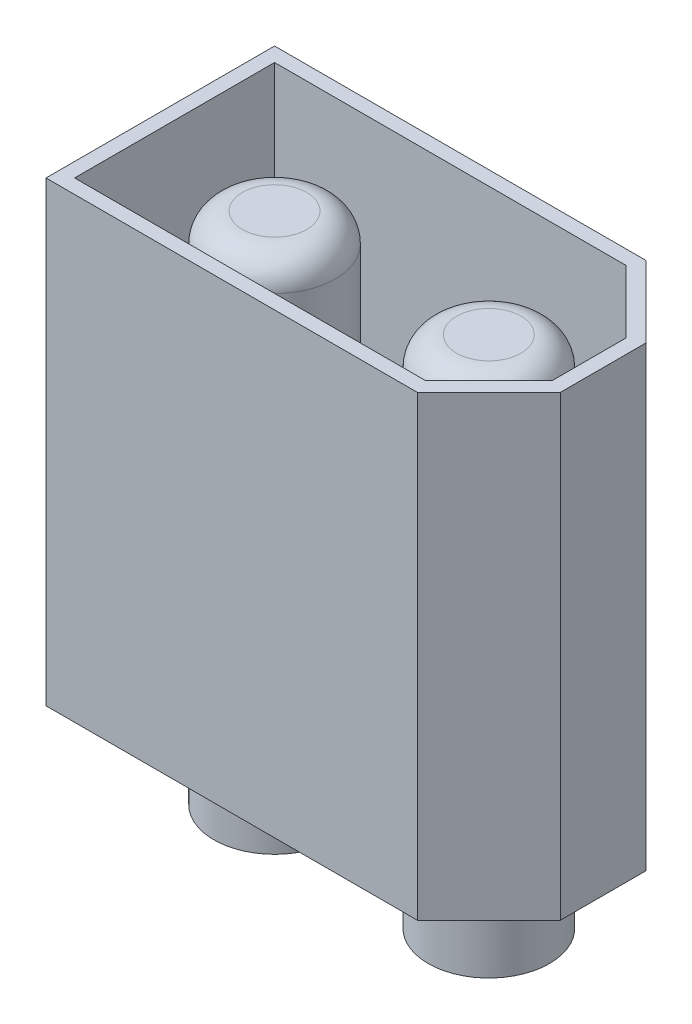
ISO-10303-21;
HEADER;
FILE_DESCRIPTION(('STEP AP214'),'2;1');
FILE_NAME('part.step','',(''),(''),'','','');
FILE_SCHEMA(('AUTOMOTIVE_DESIGN { 1 0 10303 214 1 1 1 1 }'));
ENDSEC;
DATA;
#1=APPLICATION_CONTEXT('core data for automotive mechanical design processes');
#2=APPLICATION_PROTOCOL_DEFINITION('international standard','automotive_design',2000,#1);
#3=PRODUCT_CONTEXT('',#1,'mechanical');
#4=PRODUCT('Part','Part','',(#3));
#5=PRODUCT_RELATED_PRODUCT_CATEGORY('part','',(#4));
#6=PRODUCT_DEFINITION_FORMATION('','',#4);
#7=PRODUCT_DEFINITION_CONTEXT('part definition',#1,'design');
#8=PRODUCT_DEFINITION('design','',#6,#7);
#9=PRODUCT_DEFINITION_SHAPE('','',#8);
#10=(LENGTH_UNIT() NAMED_UNIT(*) SI_UNIT(.MILLI.,.METRE.));
#11=(NAMED_UNIT(*) PLANE_ANGLE_UNIT() SI_UNIT($,.RADIAN.));
#12=(NAMED_UNIT(*) SI_UNIT($,.STERADIAN.) SOLID_ANGLE_UNIT());
#13=UNCERTAINTY_MEASURE_WITH_UNIT(LENGTH_MEASURE(1.E-05),#10,'distance_accuracy_value','');
#14=(GEOMETRIC_REPRESENTATION_CONTEXT(3) GLOBAL_UNCERTAINTY_ASSIGNED_CONTEXT((#13)) GLOBAL_UNIT_ASSIGNED_CONTEXT((#10,
#11,#12)) REPRESENTATION_CONTEXT('',''));
#15=CARTESIAN_POINT('',(0.,0.,0.));
#16=DIRECTION('',(0.,0.,1.));
#17=DIRECTION('',(1.,0.,0.));
#18=AXIS2_PLACEMENT_3D('',#15,#16,#17);
#19=CARTESIAN_POINT('',(0.,16.,4.));
#20=DIRECTION('',(0.,0.,-1.));
#21=DIRECTION('',(-1.,0.,0.));
#22=AXIS2_PLACEMENT_3D('',#19,#20,#21);
#23=PLANE('',#22);
#24=DIRECTION('',(1.,0.,0.));
#25=VECTOR('',#24,1.);
#26=CARTESIAN_POINT('',(0.,0.,4.));
#27=LINE('',#26,#25);
#28=CARTESIAN_POINT('',(-7.75,0.,4.));
#29=VERTEX_POINT('',#28);
#30=CARTESIAN_POINT('',(5.25,0.,4.));
#31=VERTEX_POINT('',#30);
#32=EDGE_CURVE('E154',#29,#31,#27,.T.);
#33=ORIENTED_EDGE('',*,*,#32,.T.);
#34=DIRECTION('',(0.,-1.,0.));
#35=VECTOR('',#34,1.);
#36=CARTESIAN_POINT('',(5.25,16.,4.));
#37=LINE('',#36,#35);
#38=CARTESIAN_POINT('',(5.25,16.,4.));
#39=VERTEX_POINT('',#38);
#40=EDGE_CURVE('E184',#39,#31,#37,.T.);
#41=ORIENTED_EDGE('',*,*,#40,.F.);
#42=DIRECTION('',(1.,0.,0.));
#43=VECTOR('',#42,1.);
#44=CARTESIAN_POINT('',(0.,16.,4.));
#45=LINE('',#44,#43);
#46=CARTESIAN_POINT('',(-7.75,16.,4.));
#47=VERTEX_POINT('',#46);
#48=EDGE_CURVE('E174',#47,#39,#45,.T.);
#49=ORIENTED_EDGE('',*,*,#48,.F.);
#50=DIRECTION('',(0.,-1.,0.));
#51=VECTOR('',#50,1.);
#52=CARTESIAN_POINT('',(-7.75,16.,4.));
#53=LINE('',#52,#51);
#54=EDGE_CURVE('E150',#47,#29,#53,.T.);
#55=ORIENTED_EDGE('',*,*,#54,.T.);
#56=EDGE_LOOP('',(#33,#41,#49,#55));
#57=FACE_BOUND('',#56,.T.);
#58=ADVANCED_FACE('F53',(#57),#23,.F.);
#59=CARTESIAN_POINT('',(4.625,16.,4.625));
#60=DIRECTION('',(-0.707106781186547,0.,-0.707106781186547));
#61=DIRECTION('',(-0.707106781186548,0.,0.707106781186548));
#62=AXIS2_PLACEMENT_3D('',#59,#60,#61);
#63=PLANE('',#62);
#64=DIRECTION('',(0.707106781186548,0.,-0.707106781186548));
#65=VECTOR('',#64,1.);
#66=CARTESIAN_POINT('',(4.625,0.,4.625));
#67=LINE('',#66,#65);
#68=CARTESIAN_POINT('',(7.75,0.,1.5));
#69=VERTEX_POINT('',#68);
#70=EDGE_CURVE('E158',#31,#69,#67,.T.);
#71=ORIENTED_EDGE('',*,*,#70,.T.);
#72=DIRECTION('',(0.,-1.,0.));
#73=VECTOR('',#72,1.);
#74=CARTESIAN_POINT('',(7.75,16.,1.5));
#75=LINE('',#74,#73);
#76=CARTESIAN_POINT('',(7.75,16.,1.5));
#77=VERTEX_POINT('',#76);
#78=EDGE_CURVE('E181',#77,#69,#75,.T.);
#79=ORIENTED_EDGE('',*,*,#78,.F.);
#80=DIRECTION('',(0.707106781186548,0.,-0.707106781186548));
#81=VECTOR('',#80,1.);
#82=CARTESIAN_POINT('',(4.625,16.,4.625));
#83=LINE('',#82,#81);
#84=EDGE_CURVE('E114',#39,#77,#83,.T.);
#85=ORIENTED_EDGE('',*,*,#84,.F.);
#86=ORIENTED_EDGE('',*,*,#40,.T.);
#87=EDGE_LOOP('',(#71,#79,#85,#86));
#88=FACE_BOUND('',#87,.T.);
#89=ADVANCED_FACE('F214',(#88),#63,.F.);
#90=CARTESIAN_POINT('',(7.75,16.,0.));
#91=DIRECTION('',(1.,0.,0.));
#92=DIRECTION('',(0.,0.,-1.));
#93=AXIS2_PLACEMENT_3D('',#90,#91,#92);
#94=PLANE('',#93);
#95=DIRECTION('',(0.,0.,1.));
#96=VECTOR('',#95,1.);
#97=CARTESIAN_POINT('',(7.75,0.,0.));
#98=LINE('',#97,#96);
#99=CARTESIAN_POINT('',(7.75,0.,-1.5));
#100=VERTEX_POINT('',#99);
#101=EDGE_CURVE('E163',#100,#69,#98,.T.);
#102=ORIENTED_EDGE('',*,*,#101,.F.);
#103=DIRECTION('',(0.,-1.,0.));
#104=VECTOR('',#103,1.);
#105=CARTESIAN_POINT('',(7.75,16.,-1.5));
#106=LINE('',#105,#104);
#107=CARTESIAN_POINT('',(7.75,16.,-1.5));
#108=VERTEX_POINT('',#107);
#109=EDGE_CURVE('E136',#108,#100,#106,.T.);
#110=ORIENTED_EDGE('',*,*,#109,.F.);
#111=DIRECTION('',(0.,0.,1.));
#112=VECTOR('',#111,1.);
#113=CARTESIAN_POINT('',(7.75,16.,0.));
#114=LINE('',#113,#112);
#115=EDGE_CURVE('E143',#108,#77,#114,.T.);
#116=ORIENTED_EDGE('',*,*,#115,.T.);
#117=ORIENTED_EDGE('',*,*,#78,.T.);
#118=EDGE_LOOP('',(#102,#110,#116,#117));
#119=FACE_BOUND('',#118,.T.);
#120=ADVANCED_FACE('F220',(#119),#94,.T.);
#121=CARTESIAN_POINT('',(4.625,16.,-4.625));
#122=DIRECTION('',(0.707106781186547,0.,-0.707106781186548));
#123=DIRECTION('',(-0.707106781186548,0.,-0.707106781186547));
#124=AXIS2_PLACEMENT_3D('',#121,#122,#123);
#125=PLANE('',#124);
#126=DIRECTION('',(0.707106781186548,0.,0.707106781186547));
#127=VECTOR('',#126,1.);
#128=CARTESIAN_POINT('',(4.625,0.,-4.625));
#129=LINE('',#128,#127);
#130=CARTESIAN_POINT('',(5.25,0.,-4.));
#131=VERTEX_POINT('',#130);
#132=EDGE_CURVE('E130',#131,#100,#129,.T.);
#133=ORIENTED_EDGE('',*,*,#132,.F.);
#134=DIRECTION('',(0.,-1.,0.));
#135=VECTOR('',#134,1.);
#136=CARTESIAN_POINT('',(5.25,16.,-4.));
#137=LINE('',#136,#135);
#138=CARTESIAN_POINT('',(5.25,16.,-4.));
#139=VERTEX_POINT('',#138);
#140=EDGE_CURVE('E125',#139,#131,#137,.T.);
#141=ORIENTED_EDGE('',*,*,#140,.F.);
#142=DIRECTION('',(0.707106781186548,0.,0.707106781186547));
#143=VECTOR('',#142,1.);
#144=CARTESIAN_POINT('',(4.625,16.,-4.625));
#145=LINE('',#144,#143);
#146=EDGE_CURVE('E128',#139,#108,#145,.T.);
#147=ORIENTED_EDGE('',*,*,#146,.T.);
#148=ORIENTED_EDGE('',*,*,#109,.T.);
#149=EDGE_LOOP('',(#133,#141,#147,#148));
#150=FACE_BOUND('',#149,.T.);
#151=ADVANCED_FACE('F127',(#150),#125,.T.);
#152=CARTESIAN_POINT('',(0.,16.,-4.));
#153=DIRECTION('',(0.,0.,-1.));
#154=DIRECTION('',(-1.,0.,0.));
#155=AXIS2_PLACEMENT_3D('',#152,#153,#154);
#156=PLANE('',#155);
#157=DIRECTION('',(1.,0.,0.));
#158=VECTOR('',#157,1.);
#159=CARTESIAN_POINT('',(0.,0.,-4.));
#160=LINE('',#159,#158);
#161=CARTESIAN_POINT('',(-7.75,0.,-4.));
#162=VERTEX_POINT('',#161);
#163=EDGE_CURVE('E169',#162,#131,#160,.T.);
#164=ORIENTED_EDGE('',*,*,#163,.F.);
#165=DIRECTION('',(0.,-1.,0.));
#166=VECTOR('',#165,1.);
#167=CARTESIAN_POINT('',(-7.75,16.,-4.));
#168=LINE('',#167,#166);
#169=CARTESIAN_POINT('',(-7.75,16.,-4.));
#170=VERTEX_POINT('',#169);
#171=EDGE_CURVE('E137',#170,#162,#168,.T.);
#172=ORIENTED_EDGE('',*,*,#171,.F.);
#173=DIRECTION('',(1.,0.,0.));
#174=VECTOR('',#173,1.);
#175=CARTESIAN_POINT('',(0.,16.,-4.));
#176=LINE('',#175,#174);
#177=EDGE_CURVE('E141',#170,#139,#176,.T.);
#178=ORIENTED_EDGE('',*,*,#177,.T.);
#179=ORIENTED_EDGE('',*,*,#140,.T.);
#180=EDGE_LOOP('',(#164,#172,#178,#179));
#181=FACE_BOUND('',#180,.T.);
#182=ADVANCED_FACE('F146',(#181),#156,.T.);
#183=CARTESIAN_POINT('',(-7.75,16.,0.));
#184=DIRECTION('',(1.,0.,0.));
#185=DIRECTION('',(0.,0.,-1.));
#186=AXIS2_PLACEMENT_3D('',#183,#184,#185);
#187=PLANE('',#186);
#188=DIRECTION('',(0.,0.,1.));
#189=VECTOR('',#188,1.);
#190=CARTESIAN_POINT('',(-7.75,0.,0.));
#191=LINE('',#190,#189);
#192=EDGE_CURVE('E105',#162,#29,#191,.T.);
#193=ORIENTED_EDGE('',*,*,#192,.T.);
#194=ORIENTED_EDGE('',*,*,#54,.F.);
#195=DIRECTION('',(0.,0.,1.));
#196=VECTOR('',#195,1.);
#197=CARTESIAN_POINT('',(-7.75,16.,0.));
#198=LINE('',#197,#196);
#199=EDGE_CURVE('E78',#170,#47,#198,.T.);
#200=ORIENTED_EDGE('',*,*,#199,.F.);
#201=ORIENTED_EDGE('',*,*,#171,.T.);
#202=EDGE_LOOP('',(#193,#194,#200,#201));
#203=FACE_BOUND('',#202,.T.);
#204=ADVANCED_FACE('F230',(#203),#187,.F.);
#205=CARTESIAN_POINT('',(0.,16.,0.));
#206=DIRECTION('',(0.,1.,0.));
#207=DIRECTION('',(0.,0.,1.));
#208=AXIS2_PLACEMENT_3D('',#205,#206,#207);
#209=PLANE('',#208);
#210=DIRECTION('',(1.,0.,0.));
#211=VECTOR('',#210,1.);
#212=CARTESIAN_POINT('',(0.,16.,3.5));
#213=LINE('',#212,#211);
#214=CARTESIAN_POINT('',(-7.25,16.,3.5));
#215=VERTEX_POINT('',#214);
#216=CARTESIAN_POINT('',(5.04289321881345,16.,3.5));
#217=VERTEX_POINT('',#216);
#218=EDGE_CURVE('E686',#215,#217,#213,.T.);
#219=ORIENTED_EDGE('',*,*,#218,.F.);
#220=DIRECTION('',(0.,0.,1.));
#221=VECTOR('',#220,1.);
#222=CARTESIAN_POINT('',(-7.25,16.,0.));
#223=LINE('',#222,#221);
#224=CARTESIAN_POINT('',(-7.25,16.,-3.5));
#225=VERTEX_POINT('',#224);
#226=EDGE_CURVE('E653',#225,#215,#223,.T.);
#227=ORIENTED_EDGE('',*,*,#226,.F.);
#228=DIRECTION('',(1.,0.,0.));
#229=VECTOR('',#228,1.);
#230=CARTESIAN_POINT('',(0.,16.,-3.5));
#231=LINE('',#230,#229);
#232=CARTESIAN_POINT('',(5.04289321881345,16.,-3.5));
#233=VERTEX_POINT('',#232);
#234=EDGE_CURVE('E69',#225,#233,#231,.T.);
#235=ORIENTED_EDGE('',*,*,#234,.T.);
#236=DIRECTION('',(0.707106781186548,0.,0.707106781186547));
#237=VECTOR('',#236,1.);
#238=CARTESIAN_POINT('',(4.27144660940673,16.,-4.27144660940673));
#239=LINE('',#238,#237);
#240=CARTESIAN_POINT('',(7.25,16.,-1.29289321881345));
#241=VERTEX_POINT('',#240);
#242=EDGE_CURVE('E698',#233,#241,#239,.T.);
#243=ORIENTED_EDGE('',*,*,#242,.T.);
#244=DIRECTION('',(0.,0.,1.));
#245=VECTOR('',#244,1.);
#246=CARTESIAN_POINT('',(7.25,16.,0.));
#247=LINE('',#246,#245);
#248=CARTESIAN_POINT('',(7.25,16.,1.29289321881345));
#249=VERTEX_POINT('',#248);
#250=EDGE_CURVE('E694',#241,#249,#247,.T.);
#251=ORIENTED_EDGE('',*,*,#250,.T.);
#252=DIRECTION('',(0.707106781186548,0.,-0.707106781186548));
#253=VECTOR('',#252,1.);
#254=CARTESIAN_POINT('',(4.27144660940673,16.,4.27144660940673));
#255=LINE('',#254,#253);
#256=EDGE_CURVE('E690',#217,#249,#255,.T.);
#257=ORIENTED_EDGE('',*,*,#256,.F.);
#258=EDGE_LOOP('',(#219,#227,#235,#243,#251,#257));
#259=FACE_BOUND('',#258,.T.);
#260=ORIENTED_EDGE('',*,*,#48,.T.);
#261=ORIENTED_EDGE('',*,*,#84,.T.);
#262=ORIENTED_EDGE('',*,*,#115,.F.);
#263=ORIENTED_EDGE('',*,*,#146,.F.);
#264=ORIENTED_EDGE('',*,*,#177,.F.);
#265=ORIENTED_EDGE('',*,*,#199,.T.);
#266=EDGE_LOOP('',(#260,#261,#262,#263,#264,#265));
#267=FACE_BOUND('',#266,.T.);
#268=ADVANCED_FACE('F140',(#259,#267),#209,.T.);
#269=CARTESIAN_POINT('',(0.,0.,0.));
#270=DIRECTION('',(0.,1.,0.));
#271=DIRECTION('',(0.,0.,1.));
#272=AXIS2_PLACEMENT_3D('',#269,#270,#271);
#273=PLANE('',#272);
#274=CARTESIAN_POINT('',(-3.75,0.,0.));
#275=DIRECTION('',(0.,-1.,0.));
#276=DIRECTION('',(0.,0.,-1.));
#277=AXIS2_PLACEMENT_3D('',#274,#275,#276);
#278=CIRCLE('',#277,3.);
#279=CARTESIAN_POINT('',(-3.75,0.,-3.));
#280=VERTEX_POINT('',#279);
#281=EDGE_CURVE('E629',#280,#280,#278,.T.);
#282=ORIENTED_EDGE('',*,*,#281,.F.);
#283=EDGE_LOOP('',(#282));
#284=FACE_BOUND('',#283,.T.);
#285=CARTESIAN_POINT('',(3.75,0.,0.));
#286=DIRECTION('',(0.,-1.,0.));
#287=DIRECTION('',(0.,0.,1.));
#288=AXIS2_PLACEMENT_3D('',#285,#286,#287);
#289=CIRCLE('',#288,3.);
#290=CARTESIAN_POINT('',(3.75,0.,3.));
#291=VERTEX_POINT('',#290);
#292=EDGE_CURVE('E633',#291,#291,#289,.T.);
#293=ORIENTED_EDGE('',*,*,#292,.F.);
#294=EDGE_LOOP('',(#293));
#295=FACE_BOUND('',#294,.T.);
#296=ORIENTED_EDGE('',*,*,#32,.F.);
#297=ORIENTED_EDGE('',*,*,#192,.F.);
#298=ORIENTED_EDGE('',*,*,#163,.T.);
#299=ORIENTED_EDGE('',*,*,#132,.T.);
#300=ORIENTED_EDGE('',*,*,#101,.T.);
#301=ORIENTED_EDGE('',*,*,#70,.F.);
#302=EDGE_LOOP('',(#296,#297,#298,#299,#300,#301));
#303=FACE_BOUND('',#302,.T.);
#304=ADVANCED_FACE('F233',(#284,#295,#303),#273,.F.);
#305=CARTESIAN_POINT('',(0.,16.,3.5));
#306=DIRECTION('',(0.,0.,-1.));
#307=DIRECTION('',(-1.,0.,0.));
#308=AXIS2_PLACEMENT_3D('',#305,#306,#307);
#309=PLANE('',#308);
#310=DIRECTION('',(1.,0.,0.));
#311=VECTOR('',#310,1.);
#312=CARTESIAN_POINT('',(0.,7.,3.5));
#313=LINE('',#312,#311);
#314=CARTESIAN_POINT('',(-7.25,7.,3.5));
#315=VERTEX_POINT('',#314);
#316=CARTESIAN_POINT('',(5.04289321881345,7.,3.5));
#317=VERTEX_POINT('',#316);
#318=EDGE_CURVE('E628',#315,#317,#313,.T.);
#319=ORIENTED_EDGE('',*,*,#318,.F.);
#320=DIRECTION('',(0.,-1.,0.));
#321=VECTOR('',#320,1.);
#322=CARTESIAN_POINT('',(-7.25,16.,3.5));
#323=LINE('',#322,#321);
#324=EDGE_CURVE('E648',#215,#315,#323,.T.);
#325=ORIENTED_EDGE('',*,*,#324,.F.);
#326=ORIENTED_EDGE('',*,*,#218,.T.);
#327=DIRECTION('',(0.,-1.,0.));
#328=VECTOR('',#327,1.);
#329=CARTESIAN_POINT('',(5.04289321881345,16.,3.5));
#330=LINE('',#329,#328);
#331=EDGE_CURVE('E159',#217,#317,#330,.T.);
#332=ORIENTED_EDGE('',*,*,#331,.T.);
#333=EDGE_LOOP('',(#319,#325,#326,#332));
#334=FACE_BOUND('',#333,.T.);
#335=ADVANCED_FACE('F236',(#334),#309,.T.);
#336=CARTESIAN_POINT('',(4.27144660940673,16.,4.27144660940673));
#337=DIRECTION('',(-0.707106781186547,0.,-0.707106781186547));
#338=DIRECTION('',(-0.707106781186548,0.,0.707106781186548));
#339=AXIS2_PLACEMENT_3D('',#336,#337,#338);
#340=PLANE('',#339);
#341=DIRECTION('',(0.707106781186548,0.,-0.707106781186548));
#342=VECTOR('',#341,1.);
#343=CARTESIAN_POINT('',(4.27144660940673,7.,4.27144660940673));
#344=LINE('',#343,#342);
#345=CARTESIAN_POINT('',(7.25,7.,1.29289321881345));
#346=VERTEX_POINT('',#345);
#347=EDGE_CURVE('E643',#317,#346,#344,.T.);
#348=ORIENTED_EDGE('',*,*,#347,.F.);
#349=ORIENTED_EDGE('',*,*,#331,.F.);
#350=ORIENTED_EDGE('',*,*,#256,.T.);
#351=DIRECTION('',(0.,-1.,0.));
#352=VECTOR('',#351,1.);
#353=CARTESIAN_POINT('',(7.25,16.,1.29289321881345));
#354=LINE('',#353,#352);
#355=EDGE_CURVE('E647',#249,#346,#354,.T.);
#356=ORIENTED_EDGE('',*,*,#355,.T.);
#357=EDGE_LOOP('',(#348,#349,#350,#356));
#358=FACE_BOUND('',#357,.T.);
#359=ADVANCED_FACE('F260',(#358),#340,.T.);
#360=CARTESIAN_POINT('',(7.25,16.,0.));
#361=DIRECTION('',(1.,0.,0.));
#362=DIRECTION('',(0.,0.,-1.));
#363=AXIS2_PLACEMENT_3D('',#360,#361,#362);
#364=PLANE('',#363);
#365=DIRECTION('',(0.,0.,1.));
#366=VECTOR('',#365,1.);
#367=CARTESIAN_POINT('',(7.25,7.,0.));
#368=LINE('',#367,#366);
#369=CARTESIAN_POINT('',(7.25,7.,-1.29289321881345));
#370=VERTEX_POINT('',#369);
#371=EDGE_CURVE('E657',#370,#346,#368,.T.);
#372=ORIENTED_EDGE('',*,*,#371,.T.);
#373=ORIENTED_EDGE('',*,*,#355,.F.);
#374=ORIENTED_EDGE('',*,*,#250,.F.);
#375=DIRECTION('',(0.,-1.,0.));
#376=VECTOR('',#375,1.);
#377=CARTESIAN_POINT('',(7.25,16.,-1.29289321881345));
#378=LINE('',#377,#376);
#379=EDGE_CURVE('E661',#241,#370,#378,.T.);
#380=ORIENTED_EDGE('',*,*,#379,.T.);
#381=EDGE_LOOP('',(#372,#373,#374,#380));
#382=FACE_BOUND('',#381,.T.);
#383=ADVANCED_FACE('F256',(#382),#364,.F.);
#384=CARTESIAN_POINT('',(4.27144660940673,16.,-4.27144660940673));
#385=DIRECTION('',(0.707106781186547,0.,-0.707106781186548));
#386=DIRECTION('',(-0.707106781186548,0.,-0.707106781186547));
#387=AXIS2_PLACEMENT_3D('',#384,#385,#386);
#388=PLANE('',#387);
#389=DIRECTION('',(0.707106781186548,0.,0.707106781186547));
#390=VECTOR('',#389,1.);
#391=CARTESIAN_POINT('',(4.27144660940673,7.,-4.27144660940673));
#392=LINE('',#391,#390);
#393=CARTESIAN_POINT('',(5.04289321881345,7.,-3.5));
#394=VERTEX_POINT('',#393);
#395=EDGE_CURVE('E665',#394,#370,#392,.T.);
#396=ORIENTED_EDGE('',*,*,#395,.T.);
#397=ORIENTED_EDGE('',*,*,#379,.F.);
#398=ORIENTED_EDGE('',*,*,#242,.F.);
#399=DIRECTION('',(0.,-1.,0.));
#400=VECTOR('',#399,1.);
#401=CARTESIAN_POINT('',(5.04289321881345,16.,-3.5));
#402=LINE('',#401,#400);
#403=EDGE_CURVE('E669',#233,#394,#402,.T.);
#404=ORIENTED_EDGE('',*,*,#403,.T.);
#405=EDGE_LOOP('',(#396,#397,#398,#404));
#406=FACE_BOUND('',#405,.T.);
#407=ADVANCED_FACE('F253',(#406),#388,.F.);
#408=CARTESIAN_POINT('',(0.,16.,-3.5));
#409=DIRECTION('',(0.,0.,-1.));
#410=DIRECTION('',(-1.,0.,0.));
#411=AXIS2_PLACEMENT_3D('',#408,#409,#410);
#412=PLANE('',#411);
#413=DIRECTION('',(1.,0.,0.));
#414=VECTOR('',#413,1.);
#415=CARTESIAN_POINT('',(0.,7.,-3.5));
#416=LINE('',#415,#414);
#417=CARTESIAN_POINT('',(-7.25,7.,-3.5));
#418=VERTEX_POINT('',#417);
#419=EDGE_CURVE('E673',#418,#394,#416,.T.);
#420=ORIENTED_EDGE('',*,*,#419,.T.);
#421=ORIENTED_EDGE('',*,*,#403,.F.);
#422=ORIENTED_EDGE('',*,*,#234,.F.);
#423=DIRECTION('',(0.,-1.,0.));
#424=VECTOR('',#423,1.);
#425=CARTESIAN_POINT('',(-7.25,16.,-3.5));
#426=LINE('',#425,#424);
#427=EDGE_CURVE('E652',#225,#418,#426,.T.);
#428=ORIENTED_EDGE('',*,*,#427,.T.);
#429=EDGE_LOOP('',(#420,#421,#422,#428));
#430=FACE_BOUND('',#429,.T.);
#431=ADVANCED_FACE('F249',(#430),#412,.F.);
#432=CARTESIAN_POINT('',(-7.25,16.,0.));
#433=DIRECTION('',(1.,0.,0.));
#434=DIRECTION('',(0.,0.,-1.));
#435=AXIS2_PLACEMENT_3D('',#432,#433,#434);
#436=PLANE('',#435);
#437=DIRECTION('',(0.,0.,1.));
#438=VECTOR('',#437,1.);
#439=CARTESIAN_POINT('',(-7.25,7.,0.));
#440=LINE('',#439,#438);
#441=EDGE_CURVE('E680',#418,#315,#440,.T.);
#442=ORIENTED_EDGE('',*,*,#441,.F.);
#443=ORIENTED_EDGE('',*,*,#427,.F.);
#444=ORIENTED_EDGE('',*,*,#226,.T.);
#445=ORIENTED_EDGE('',*,*,#324,.T.);
#446=EDGE_LOOP('',(#442,#443,#444,#445));
#447=FACE_BOUND('',#446,.T.);
#448=ADVANCED_FACE('F245',(#447),#436,.T.);
#449=CARTESIAN_POINT('',(0.,7.,0.));
#450=DIRECTION('',(0.,1.,0.));
#451=DIRECTION('',(0.,0.,1.));
#452=AXIS2_PLACEMENT_3D('',#449,#450,#451);
#453=PLANE('',#452);
#454=CARTESIAN_POINT('',(3.75,7.,0.));
#455=DIRECTION('',(0.,1.,0.));
#456=DIRECTION('',(0.,0.,1.));
#457=AXIS2_PLACEMENT_3D('',#454,#455,#456);
#458=CIRCLE('',#457,2.125);
#459=CARTESIAN_POINT('',(3.75,7.,2.125));
#460=VERTEX_POINT('',#459);
#461=EDGE_CURVE('E603',#460,#460,#458,.T.);
#462=ORIENTED_EDGE('',*,*,#461,.F.);
#463=EDGE_LOOP('',(#462));
#464=FACE_BOUND('',#463,.T.);
#465=CARTESIAN_POINT('',(-3.75,7.,0.));
#466=DIRECTION('',(0.,1.,0.));
#467=DIRECTION('',(0.,0.,1.));
#468=AXIS2_PLACEMENT_3D('',#465,#466,#467);
#469=CIRCLE('',#468,2.125);
#470=CARTESIAN_POINT('',(-3.75,7.,2.125));
#471=VERTEX_POINT('',#470);
#472=EDGE_CURVE('E605',#471,#471,#469,.T.);
#473=ORIENTED_EDGE('',*,*,#472,.F.);
#474=EDGE_LOOP('',(#473));
#475=FACE_BOUND('',#474,.T.);
#476=ORIENTED_EDGE('',*,*,#318,.T.);
#477=ORIENTED_EDGE('',*,*,#347,.T.);
#478=ORIENTED_EDGE('',*,*,#371,.F.);
#479=ORIENTED_EDGE('',*,*,#395,.F.);
#480=ORIENTED_EDGE('',*,*,#419,.F.);
#481=ORIENTED_EDGE('',*,*,#441,.T.);
#482=EDGE_LOOP('',(#476,#477,#478,#479,#480,#481));
#483=FACE_BOUND('',#482,.T.);
#484=ADVANCED_FACE('F241',(#464,#475,#483),#453,.T.);
#485=CARTESIAN_POINT('',(3.75,1.5,0.));
#486=DIRECTION('',(0.,-1.,0.));
#487=DIRECTION('',(0.,0.,-1.));
#488=AXIS2_PLACEMENT_3D('',#485,#486,#487);
#489=CYLINDRICAL_SURFACE('',#488,3.);
#490=CARTESIAN_POINT('',(3.75,1.5,0.));
#491=DIRECTION('',(0.,-1.,0.));
#492=DIRECTION('',(0.,0.,1.));
#493=AXIS2_PLACEMENT_3D('',#490,#491,#492);
#494=CIRCLE('',#493,3.);
#495=CARTESIAN_POINT('',(3.75,1.5,3.));
#496=VERTEX_POINT('',#495);
#497=EDGE_CURVE('E620',#496,#496,#494,.T.);
#498=ORIENTED_EDGE('',*,*,#497,.F.);
#499=EDGE_LOOP('',(#498));
#500=FACE_BOUND('',#499,.T.);
#501=ORIENTED_EDGE('',*,*,#292,.T.);
#502=EDGE_LOOP('',(#501));
#503=FACE_BOUND('',#502,.T.);
#504=ADVANCED_FACE('F244',(#500,#503),#489,.F.);
#505=CARTESIAN_POINT('',(3.75,1.5,0.));
#506=DIRECTION('',(0.,1.,0.));
#507=DIRECTION('',(0.,0.,1.));
#508=AXIS2_PLACEMENT_3D('',#505,#506,#507);
#509=PLANE('',#508);
#510=CARTESIAN_POINT('',(3.75,1.5,0.));
#511=DIRECTION('',(0.,1.,0.));
#512=DIRECTION('',(0.,0.,1.));
#513=AXIS2_PLACEMENT_3D('',#510,#511,#512);
#514=CIRCLE('',#513,2.125);
#515=CARTESIAN_POINT('',(3.75,1.5,2.125));
#516=VERTEX_POINT('',#515);
#517=EDGE_CURVE('E187',#516,#516,#514,.F.);
#518=ORIENTED_EDGE('',*,*,#517,.F.);
#519=EDGE_LOOP('',(#518));
#520=FACE_BOUND('',#519,.T.);
#521=ORIENTED_EDGE('',*,*,#497,.T.);
#522=EDGE_LOOP('',(#521));
#523=FACE_BOUND('',#522,.T.);
#524=ADVANCED_FACE('F268',(#520,#523),#509,.F.);
#525=CARTESIAN_POINT('',(-3.75,1.5,0.));
#526=DIRECTION('',(0.,-1.,0.));
#527=DIRECTION('',(0.,0.,-1.));
#528=AXIS2_PLACEMENT_3D('',#525,#526,#527);
#529=CYLINDRICAL_SURFACE('',#528,3.);
#530=CARTESIAN_POINT('',(-3.75,1.5,0.));
#531=DIRECTION('',(0.,-1.,0.));
#532=DIRECTION('',(0.,0.,-1.));
#533=AXIS2_PLACEMENT_3D('',#530,#531,#532);
#534=CIRCLE('',#533,3.);
#535=CARTESIAN_POINT('',(-3.75,1.5,-3.));
#536=VERTEX_POINT('',#535);
#537=EDGE_CURVE('E624',#536,#536,#534,.T.);
#538=ORIENTED_EDGE('',*,*,#537,.F.);
#539=EDGE_LOOP('',(#538));
#540=FACE_BOUND('',#539,.T.);
#541=ORIENTED_EDGE('',*,*,#281,.T.);
#542=EDGE_LOOP('',(#541));
#543=FACE_BOUND('',#542,.T.);
#544=ADVANCED_FACE('F271',(#540,#543),#529,.F.);
#545=CARTESIAN_POINT('',(-3.75,1.5,0.));
#546=DIRECTION('',(0.,-1.,0.));
#547=DIRECTION('',(0.,0.,-1.));
#548=AXIS2_PLACEMENT_3D('',#545,#546,#547);
#549=PLANE('',#548);
#550=CARTESIAN_POINT('',(-3.75,1.5,0.));
#551=DIRECTION('',(0.,-1.,0.));
#552=DIRECTION('',(0.,0.,-1.));
#553=AXIS2_PLACEMENT_3D('',#550,#551,#552);
#554=CIRCLE('',#553,2.125);
#555=CARTESIAN_POINT('',(-3.75,1.5,-2.125));
#556=VERTEX_POINT('',#555);
#557=EDGE_CURVE('E615',#556,#556,#554,.T.);
#558=ORIENTED_EDGE('',*,*,#557,.F.);
#559=EDGE_LOOP('',(#558));
#560=FACE_BOUND('',#559,.T.);
#561=ORIENTED_EDGE('',*,*,#537,.T.);
#562=EDGE_LOOP('',(#561));
#563=FACE_BOUND('',#562,.T.);
#564=ADVANCED_FACE('F278',(#560,#563),#549,.T.);
#565=CARTESIAN_POINT('',(-3.75,-3.,0.));
#566=DIRECTION('',(0.,1.,0.));
#567=DIRECTION('',(0.,0.,1.));
#568=AXIS2_PLACEMENT_3D('',#565,#566,#567);
#569=CYLINDRICAL_SURFACE('',#568,2.125);
#570=CARTESIAN_POINT('',(-3.75,-3.,0.));
#571=DIRECTION('',(0.,-1.,0.));
#572=DIRECTION('',(0.,0.,-1.));
#573=AXIS2_PLACEMENT_3D('',#570,#571,#572);
#574=CIRCLE('',#573,2.125);
#575=CARTESIAN_POINT('',(-3.75,-3.,-2.125));
#576=VERTEX_POINT('',#575);
#577=EDGE_CURVE('E616',#576,#576,#574,.T.);
#578=ORIENTED_EDGE('',*,*,#577,.F.);
#579=EDGE_LOOP('',(#578));
#580=FACE_BOUND('',#579,.T.);
#581=ORIENTED_EDGE('',*,*,#557,.T.);
#582=EDGE_LOOP('',(#581));
#583=FACE_BOUND('',#582,.T.);
#584=ADVANCED_FACE('F282',(#580,#583),#569,.T.);
#585=CARTESIAN_POINT('',(-3.75,-3.,0.));
#586=DIRECTION('',(0.,-1.,0.));
#587=DIRECTION('',(0.,0.,-1.));
#588=AXIS2_PLACEMENT_3D('',#585,#586,#587);
#589=PLANE('',#588);
#590=ORIENTED_EDGE('',*,*,#577,.T.);
#591=EDGE_LOOP('',(#590));
#592=FACE_BOUND('',#591,.T.);
#593=ADVANCED_FACE('F286',(#592),#589,.T.);
#594=CARTESIAN_POINT('',(3.75,-3.,0.));
#595=DIRECTION('',(0.,1.,0.));
#596=DIRECTION('',(0.,0.,1.));
#597=AXIS2_PLACEMENT_3D('',#594,#595,#596);
#598=CYLINDRICAL_SURFACE('',#597,2.125);
#599=CARTESIAN_POINT('',(3.75,-3.,0.));
#600=DIRECTION('',(0.,-1.,0.));
#601=DIRECTION('',(0.,0.,-1.));
#602=AXIS2_PLACEMENT_3D('',#599,#600,#601);
#603=CIRCLE('',#602,2.125);
#604=CARTESIAN_POINT('',(3.75,-3.,-2.125));
#605=VERTEX_POINT('',#604);
#606=EDGE_CURVE('E609',#605,#605,#603,.T.);
#607=ORIENTED_EDGE('',*,*,#606,.F.);
#608=EDGE_LOOP('',(#607));
#609=FACE_BOUND('',#608,.T.);
#610=ORIENTED_EDGE('',*,*,#517,.T.);
#611=EDGE_LOOP('',(#610));
#612=FACE_BOUND('',#611,.T.);
#613=ADVANCED_FACE('F290',(#609,#612),#598,.T.);
#614=CARTESIAN_POINT('',(3.75,-3.,0.));
#615=DIRECTION('',(0.,-1.,0.));
#616=DIRECTION('',(0.,0.,-1.));
#617=AXIS2_PLACEMENT_3D('',#614,#615,#616);
#618=PLANE('',#617);
#619=ORIENTED_EDGE('',*,*,#606,.T.);
#620=EDGE_LOOP('',(#619));
#621=FACE_BOUND('',#620,.T.);
#622=ADVANCED_FACE('F292',(#621),#618,.T.);
#623=CARTESIAN_POINT('',(-3.75,22.0104076400857,0.));
#624=DIRECTION('',(0.,-1.,0.));
#625=DIRECTION('',(0.,0.,-1.));
#626=AXIS2_PLACEMENT_3D('',#623,#624,#625);
#627=CYLINDRICAL_SURFACE('',#626,2.125);
#628=CARTESIAN_POINT('',(-3.75,14.,0.));
#629=DIRECTION('',(0.,1.,0.));
#630=DIRECTION('',(0.,0.,1.));
#631=AXIS2_PLACEMENT_3D('',#628,#629,#630);
#632=CIRCLE('',#631,2.125);
#633=CARTESIAN_POINT('',(-3.75,14.,2.125));
#634=VERTEX_POINT('',#633);
#635=EDGE_CURVE('E12',#634,#634,#632,.F.);
#636=ORIENTED_EDGE('',*,*,#635,.T.);
#637=EDGE_LOOP('',(#636));
#638=FACE_BOUND('',#637,.T.);
#639=ORIENTED_EDGE('',*,*,#472,.T.);
#640=EDGE_LOOP('',(#639));
#641=FACE_BOUND('',#640,.T.);
#642=ADVANCED_FACE('F295',(#638,#641),#627,.T.);
#643=CARTESIAN_POINT('',(0.,15.,0.));
#644=DIRECTION('',(0.,1.,0.));
#645=DIRECTION('',(0.,0.,1.));
#646=AXIS2_PLACEMENT_3D('',#643,#644,#645);
#647=PLANE('',#646);
#648=CARTESIAN_POINT('',(-3.75,15.,0.));
#649=DIRECTION('',(0.,1.,0.));
#650=DIRECTION('',(0.,0.,1.));
#651=AXIS2_PLACEMENT_3D('',#648,#649,#650);
#652=CIRCLE('',#651,1.125);
#653=CARTESIAN_POINT('',(-3.75,15.,1.125));
#654=VERTEX_POINT('',#653);
#655=EDGE_CURVE('E62',#654,#654,#652,.T.);
#656=ORIENTED_EDGE('',*,*,#655,.T.);
#657=EDGE_LOOP('',(#656));
#658=FACE_BOUND('',#657,.T.);
#659=ADVANCED_FACE('F202',(#658),#647,.T.);
#660=CARTESIAN_POINT('',(3.75,22.0104076400857,0.));
#661=DIRECTION('',(0.,-1.,0.));
#662=DIRECTION('',(0.,0.,-1.));
#663=AXIS2_PLACEMENT_3D('',#660,#661,#662);
#664=CYLINDRICAL_SURFACE('',#663,2.125);
#665=CARTESIAN_POINT('',(3.75,14.,0.));
#666=DIRECTION('',(0.,1.,0.));
#667=DIRECTION('',(0.,0.,1.));
#668=AXIS2_PLACEMENT_3D('',#665,#666,#667);
#669=CIRCLE('',#668,2.125);
#670=CARTESIAN_POINT('',(3.75,14.,2.125));
#671=VERTEX_POINT('',#670);
#672=EDGE_CURVE('E195',#671,#671,#669,.F.);
#673=ORIENTED_EDGE('',*,*,#672,.T.);
#674=EDGE_LOOP('',(#673));
#675=FACE_BOUND('',#674,.T.);
#676=ORIENTED_EDGE('',*,*,#461,.T.);
#677=EDGE_LOOP('',(#676));
#678=FACE_BOUND('',#677,.T.);
#679=ADVANCED_FACE('F302',(#675,#678),#664,.T.);
#680=CARTESIAN_POINT('',(0.,15.,0.));
#681=DIRECTION('',(0.,1.,0.));
#682=DIRECTION('',(0.,0.,1.));
#683=AXIS2_PLACEMENT_3D('',#680,#681,#682);
#684=PLANE('',#683);
#685=CARTESIAN_POINT('',(3.75,15.,0.));
#686=DIRECTION('',(0.,1.,0.));
#687=DIRECTION('',(0.,0.,1.));
#688=AXIS2_PLACEMENT_3D('',#685,#686,#687);
#689=CIRCLE('',#688,1.125);
#690=CARTESIAN_POINT('',(3.75,15.,1.125));
#691=VERTEX_POINT('',#690);
#692=EDGE_CURVE('E191',#691,#691,#689,.T.);
#693=ORIENTED_EDGE('',*,*,#692,.T.);
#694=EDGE_LOOP('',(#693));
#695=FACE_BOUND('',#694,.T.);
#696=ADVANCED_FACE('F210',(#695),#684,.T.);
#697=CARTESIAN_POINT('',(3.75,14.,0.));
#698=DIRECTION('',(0.,1.,0.));
#699=DIRECTION('',(0.,0.,1.));
#700=AXIS2_PLACEMENT_3D('',#697,#698,#699);
#701=TOROIDAL_SURFACE('',#700,1.125,1.);
#702=ORIENTED_EDGE('',*,*,#672,.F.);
#703=EDGE_LOOP('',(#702));
#704=FACE_BOUND('',#703,.T.);
#705=ORIENTED_EDGE('',*,*,#692,.F.);
#706=EDGE_LOOP('',(#705));
#707=FACE_BOUND('',#706,.T.);
#708=ADVANCED_FACE('F205',(#704,#707),#701,.T.);
#709=CARTESIAN_POINT('',(-3.75,14.,0.));
#710=DIRECTION('',(0.,1.,0.));
#711=DIRECTION('',(0.,0.,1.));
#712=AXIS2_PLACEMENT_3D('',#709,#710,#711);
#713=TOROIDAL_SURFACE('',#712,1.125,1.);
#714=ORIENTED_EDGE('',*,*,#635,.F.);
#715=EDGE_LOOP('',(#714));
#716=FACE_BOUND('',#715,.T.);
#717=ORIENTED_EDGE('',*,*,#655,.F.);
#718=EDGE_LOOP('',(#717));
#719=FACE_BOUND('',#718,.T.);
#720=ADVANCED_FACE('F55',(#716,#719),#713,.T.);
#721=CLOSED_SHELL('',(#58,#89,#120,#151,#182,#204,#268,#304,#335,#359,#383,#407,#431,#448,#484,
#504,#524,#544,#564,#584,#593,#613,#622,#642,#659,#679,#696,#708,#720));
#722=MANIFOLD_SOLID_BREP('B2',#721);
#723=ADVANCED_BREP_SHAPE_REPRESENTATION('',(#18,#722),#14);
#724=SHAPE_DEFINITION_REPRESENTATION(#9,#723);
ENDSEC;
END-ISO-10303-21;
